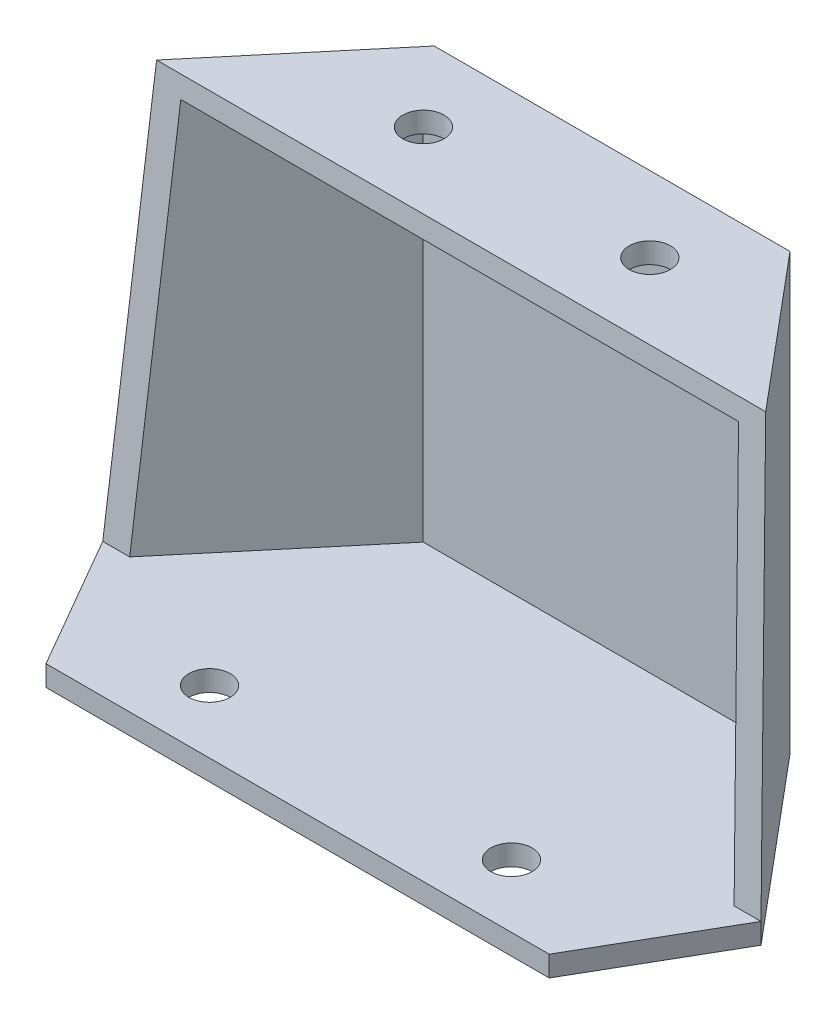
ISO-10303-21;
HEADER;
FILE_DESCRIPTION(('STEP AP214'),'2;1');
FILE_NAME('part.step','',(''),(''),'','','');
FILE_SCHEMA(('AUTOMOTIVE_DESIGN { 1 0 10303 214 1 1 1 1 }'));
ENDSEC;
DATA;
#1=APPLICATION_CONTEXT('core data for automotive mechanical design processes');
#2=APPLICATION_PROTOCOL_DEFINITION('international standard','automotive_design',2000,#1);
#3=PRODUCT_CONTEXT('',#1,'mechanical');
#4=PRODUCT('Part','Part','',(#3));
#5=PRODUCT_RELATED_PRODUCT_CATEGORY('part','',(#4));
#6=PRODUCT_DEFINITION_FORMATION('','',#4);
#7=PRODUCT_DEFINITION_CONTEXT('part definition',#1,'design');
#8=PRODUCT_DEFINITION('design','',#6,#7);
#9=PRODUCT_DEFINITION_SHAPE('','',#8);
#10=(LENGTH_UNIT() NAMED_UNIT(*) SI_UNIT(.MILLI.,.METRE.));
#11=(NAMED_UNIT(*) PLANE_ANGLE_UNIT() SI_UNIT($,.RADIAN.));
#12=(NAMED_UNIT(*) SI_UNIT($,.STERADIAN.) SOLID_ANGLE_UNIT());
#13=UNCERTAINTY_MEASURE_WITH_UNIT(LENGTH_MEASURE(1.E-05),#10,'distance_accuracy_value','');
#14=(GEOMETRIC_REPRESENTATION_CONTEXT(3) GLOBAL_UNCERTAINTY_ASSIGNED_CONTEXT((#13)) GLOBAL_UNIT_ASSIGNED_CONTEXT((#10,
#11,#12)) REPRESENTATION_CONTEXT('',''));
#15=CARTESIAN_POINT('',(0.,0.,0.));
#16=DIRECTION('',(0.,0.,1.));
#17=DIRECTION('',(1.,0.,0.));
#18=AXIS2_PLACEMENT_3D('',#15,#16,#17);
#19=CARTESIAN_POINT('',(0.,0.,0.));
#20=DIRECTION('',(0.,1.,0.));
#21=DIRECTION('',(0.,0.,1.));
#22=AXIS2_PLACEMENT_3D('',#19,#20,#21);
#23=PLANE('',#22);
#24=DIRECTION('',(-1.,0.,0.));
#25=VECTOR('',#24,1.);
#26=CARTESIAN_POINT('',(0.,0.,0.));
#27=LINE('',#26,#25);
#28=CARTESIAN_POINT('',(122.,0.,0.));
#29=VERTEX_POINT('',#28);
#30=CARTESIAN_POINT('',(-122.,0.,0.));
#31=VERTEX_POINT('',#30);
#32=EDGE_CURVE('E211',#29,#31,#27,.T.);
#33=ORIENTED_EDGE('',*,*,#32,.T.);
#34=DIRECTION('',(-0.500000000000001,0.,-0.866025403784438));
#35=VECTOR('',#34,1.);
#36=CARTESIAN_POINT('',(-91.4999999999999,0.,52.8275496308509));
#37=LINE('',#36,#35);
#38=CARTESIAN_POINT('',(-159.592352403094,0.,-65.1118643381918));
#39=VERTEX_POINT('',#38);
#40=EDGE_CURVE('E271',#31,#39,#37,.T.);
#41=ORIENTED_EDGE('',*,*,#40,.T.);
#42=DIRECTION('',(0.642787609686541,0.,-0.766044443118977));
#43=VECTOR('',#42,1.);
#44=CARTESIAN_POINT('',(-125.7139711904,0.,-105.486546859696));
#45=LINE('',#44,#43);
#46=CARTESIAN_POINT('',(-86.265,0.,-152.5));
#47=VERTEX_POINT('',#46);
#48=EDGE_CURVE('E275',#39,#47,#45,.T.);
#49=ORIENTED_EDGE('',*,*,#48,.T.);
#50=DIRECTION('',(1.,0.,0.));
#51=VECTOR('',#50,1.);
#52=CARTESIAN_POINT('',(0.,0.,-152.5));
#53=LINE('',#52,#51);
#54=CARTESIAN_POINT('',(86.265,0.,-152.5));
#55=VERTEX_POINT('',#54);
#56=EDGE_CURVE('E220',#47,#55,#53,.T.);
#57=ORIENTED_EDGE('',*,*,#56,.T.);
#58=DIRECTION('',(-0.642787609686541,0.,-0.766044443118977));
#59=VECTOR('',#58,1.);
#60=CARTESIAN_POINT('',(125.7139711904,0.,-105.486546859696));
#61=LINE('',#60,#59);
#62=CARTESIAN_POINT('',(159.592352403094,0.,-65.1118643381918));
#63=VERTEX_POINT('',#62);
#64=EDGE_CURVE('E228',#63,#55,#61,.T.);
#65=ORIENTED_EDGE('',*,*,#64,.F.);
#66=DIRECTION('',(0.500000000000001,0.,-0.866025403784438));
#67=VECTOR('',#66,1.);
#68=CARTESIAN_POINT('',(91.4999999999999,0.,52.8275496308509));
#69=LINE('',#68,#67);
#70=EDGE_CURVE('E254',#29,#63,#69,.T.);
#71=ORIENTED_EDGE('',*,*,#70,.F.);
#72=EDGE_LOOP('',(#33,#41,#49,#57,#65,#71));
#73=FACE_BOUND('',#72,.T.);
#74=CARTESIAN_POINT('',(73.2,0.,-30.5));
#75=DIRECTION('',(0.,-1.,0.));
#76=DIRECTION('',(0.,0.,-1.));
#77=AXIS2_PLACEMENT_3D('',#74,#75,#76);
#78=CIRCLE('',#77,9.99999999999999);
#79=CARTESIAN_POINT('',(73.2,0.,-40.5));
#80=VERTEX_POINT('',#79);
#81=EDGE_CURVE('E377',#80,#80,#78,.T.);
#82=ORIENTED_EDGE('',*,*,#81,.F.);
#83=EDGE_LOOP('',(#82));
#84=FACE_BOUND('',#83,.T.);
#85=CARTESIAN_POINT('',(-73.2,0.,-30.5));
#86=DIRECTION('',(0.,1.,0.));
#87=DIRECTION('',(0.,0.,1.));
#88=AXIS2_PLACEMENT_3D('',#85,#86,#87);
#89=CIRCLE('',#88,9.99999999999999);
#90=CARTESIAN_POINT('',(-73.2,0.,-20.5));
#91=VERTEX_POINT('',#90);
#92=EDGE_CURVE('E366',#91,#91,#89,.T.);
#93=ORIENTED_EDGE('',*,*,#92,.T.);
#94=EDGE_LOOP('',(#93));
#95=FACE_BOUND('',#94,.T.);
#96=ADVANCED_FACE('F89',(#73,#84,#95),#23,.F.);
#97=CARTESIAN_POINT('',(-159.592352403094,10.,0.));
#98=DIRECTION('',(0.,1.,0.));
#99=DIRECTION('',(0.,0.,1.));
#100=AXIS2_PLACEMENT_3D('',#97,#98,#99);
#101=PLANE('',#100);
#102=CARTESIAN_POINT('',(73.2,10.,-30.5));
#103=DIRECTION('',(0.,-1.,0.));
#104=DIRECTION('',(0.,0.,-1.));
#105=AXIS2_PLACEMENT_3D('',#102,#103,#104);
#106=CIRCLE('',#105,9.99999999999999);
#107=CARTESIAN_POINT('',(73.2,10.,-40.5));
#108=VERTEX_POINT('',#107);
#109=EDGE_CURVE('E381',#108,#108,#106,.T.);
#110=ORIENTED_EDGE('',*,*,#109,.T.);
#111=EDGE_LOOP('',(#110));
#112=FACE_BOUND('',#111,.T.);
#113=DIRECTION('',(1.,0.,0.));
#114=VECTOR('',#113,1.);
#115=CARTESIAN_POINT('',(-159.592352403094,10.,-65.1118643381918));
#116=LINE('',#115,#114);
#117=CARTESIAN_POINT('',(146.538279509771,10.,-65.1118643381918));
#118=VERTEX_POINT('',#117);
#119=CARTESIAN_POINT('',(159.592352403094,10.,-65.1118643381918));
#120=VERTEX_POINT('',#119);
#121=EDGE_CURVE('E182',#118,#120,#116,.T.);
#122=ORIENTED_EDGE('',*,*,#121,.F.);
#123=DIRECTION('',(-0.642787609686541,0.,-0.766044443118977));
#124=VECTOR('',#123,1.);
#125=CARTESIAN_POINT('',(118.05352675921,10.,-99.0586707628305));
#126=LINE('',#125,#124);
#127=CARTESIAN_POINT('',(81.60192341845,10.,-142.5));
#128=VERTEX_POINT('',#127);
#129=EDGE_CURVE('E109',#118,#128,#126,.T.);
#130=ORIENTED_EDGE('',*,*,#129,.T.);
#131=DIRECTION('',(1.,0.,0.));
#132=VECTOR('',#131,1.);
#133=CARTESIAN_POINT('',(0.,10.,-142.5));
#134=LINE('',#133,#132);
#135=CARTESIAN_POINT('',(-81.60192341845,10.,-142.5));
#136=VERTEX_POINT('',#135);
#137=EDGE_CURVE('E100',#136,#128,#134,.T.);
#138=ORIENTED_EDGE('',*,*,#137,.F.);
#139=DIRECTION('',(0.642787609686541,0.,-0.766044443118977));
#140=VECTOR('',#139,1.);
#141=CARTESIAN_POINT('',(-118.05352675921,10.,-99.0586707628305));
#142=LINE('',#141,#140);
#143=CARTESIAN_POINT('',(-146.538279509771,10.,-65.1118643381918));
#144=VERTEX_POINT('',#143);
#145=EDGE_CURVE('E250',#144,#136,#142,.T.);
#146=ORIENTED_EDGE('',*,*,#145,.F.);
#147=CARTESIAN_POINT('',(-159.592352403094,10.,-65.1118643381918));
#148=VERTEX_POINT('',#147);
#149=EDGE_CURVE('E187',#148,#144,#116,.T.);
#150=ORIENTED_EDGE('',*,*,#149,.F.);
#151=DIRECTION('',(-0.500000000000001,0.,-0.866025403784438));
#152=VECTOR('',#151,1.);
#153=CARTESIAN_POINT('',(-91.4999999999998,10.,52.8275496308509));
#154=LINE('',#153,#152);
#155=CARTESIAN_POINT('',(-122.,10.,0.));
#156=VERTEX_POINT('',#155);
#157=EDGE_CURVE('E221',#156,#148,#154,.T.);
#158=ORIENTED_EDGE('',*,*,#157,.F.);
#159=DIRECTION('',(1.,0.,0.));
#160=VECTOR('',#159,1.);
#161=CARTESIAN_POINT('',(-159.592352403094,10.,0.));
#162=LINE('',#161,#160);
#163=CARTESIAN_POINT('',(122.,10.,0.));
#164=VERTEX_POINT('',#163);
#165=EDGE_CURVE('E188',#156,#164,#162,.T.);
#166=ORIENTED_EDGE('',*,*,#165,.T.);
#167=DIRECTION('',(0.500000000000001,0.,-0.866025403784438));
#168=VECTOR('',#167,1.);
#169=CARTESIAN_POINT('',(91.4999999999998,10.,52.8275496308509));
#170=LINE('',#169,#168);
#171=EDGE_CURVE('E216',#164,#120,#170,.T.);
#172=ORIENTED_EDGE('',*,*,#171,.T.);
#173=EDGE_LOOP('',(#122,#130,#138,#146,#150,#158,#166,#172));
#174=FACE_BOUND('',#173,.T.);
#175=CARTESIAN_POINT('',(-73.2,10.,-30.5));
#176=DIRECTION('',(0.,1.,0.));
#177=DIRECTION('',(0.,0.,1.));
#178=AXIS2_PLACEMENT_3D('',#175,#176,#177);
#179=CIRCLE('',#178,9.99999999999999);
#180=CARTESIAN_POINT('',(-73.2,10.,-20.5));
#181=VERTEX_POINT('',#180);
#182=EDGE_CURVE('E385',#181,#181,#179,.T.);
#183=ORIENTED_EDGE('',*,*,#182,.F.);
#184=EDGE_LOOP('',(#183));
#185=FACE_BOUND('',#184,.T.);
#186=ADVANCED_FACE('F311',(#112,#174,#185),#101,.T.);
#187=CARTESIAN_POINT('',(0.,211.,0.));
#188=DIRECTION('',(0.,1.,0.));
#189=DIRECTION('',(0.,0.,1.));
#190=AXIS2_PLACEMENT_3D('',#187,#188,#189);
#191=PLANE('',#190);
#192=DIRECTION('',(0.642787609686541,0.,-0.766044443118977));
#193=VECTOR('',#192,1.);
#194=CARTESIAN_POINT('',(-125.7139711904,211.,-105.486546859696));
#195=LINE('',#194,#193);
#196=CARTESIAN_POINT('',(-147.687093002177,211.,-79.3));
#197=VERTEX_POINT('',#196);
#198=CARTESIAN_POINT('',(-86.265,211.,-152.5));
#199=VERTEX_POINT('',#198);
#200=EDGE_CURVE('E196',#197,#199,#195,.T.);
#201=ORIENTED_EDGE('',*,*,#200,.F.);
#202=DIRECTION('',(1.,0.,0.));
#203=VECTOR('',#202,1.);
#204=CARTESIAN_POINT('',(-159.592352403094,211.,-79.3));
#205=LINE('',#204,#203);
#206=CARTESIAN_POINT('',(147.687093002177,211.,-79.3));
#207=VERTEX_POINT('',#206);
#208=EDGE_CURVE('E181',#197,#207,#205,.T.);
#209=ORIENTED_EDGE('',*,*,#208,.T.);
#210=DIRECTION('',(-0.642787609686541,0.,-0.766044443118977));
#211=VECTOR('',#210,1.);
#212=CARTESIAN_POINT('',(125.7139711904,211.,-105.486546859696));
#213=LINE('',#212,#211);
#214=CARTESIAN_POINT('',(86.265,211.,-152.5));
#215=VERTEX_POINT('',#214);
#216=EDGE_CURVE('E93',#207,#215,#213,.T.);
#217=ORIENTED_EDGE('',*,*,#216,.T.);
#218=DIRECTION('',(1.,0.,0.));
#219=VECTOR('',#218,1.);
#220=CARTESIAN_POINT('',(0.,211.,-152.5));
#221=LINE('',#220,#219);
#222=EDGE_CURVE('E205',#199,#215,#221,.T.);
#223=ORIENTED_EDGE('',*,*,#222,.F.);
#224=EDGE_LOOP('',(#201,#209,#217,#223));
#225=FACE_BOUND('',#224,.T.);
#226=CARTESIAN_POINT('',(-54.9,211.,-115.9));
#227=DIRECTION('',(0.,1.,0.));
#228=DIRECTION('',(0.,0.,1.));
#229=AXIS2_PLACEMENT_3D('',#226,#227,#228);
#230=CIRCLE('',#229,10.);
#231=CARTESIAN_POINT('',(-54.9,211.,-105.9));
#232=VERTEX_POINT('',#231);
#233=EDGE_CURVE('E365',#232,#232,#230,.T.);
#234=ORIENTED_EDGE('',*,*,#233,.F.);
#235=EDGE_LOOP('',(#234));
#236=FACE_BOUND('',#235,.T.);
#237=CARTESIAN_POINT('',(54.9,211.,-115.9));
#238=DIRECTION('',(0.,-1.,0.));
#239=DIRECTION('',(0.,0.,-1.));
#240=AXIS2_PLACEMENT_3D('',#237,#238,#239);
#241=CIRCLE('',#240,10.);
#242=CARTESIAN_POINT('',(54.9,211.,-125.9));
#243=VERTEX_POINT('',#242);
#244=EDGE_CURVE('E370',#243,#243,#241,.T.);
#245=ORIENTED_EDGE('',*,*,#244,.T.);
#246=EDGE_LOOP('',(#245));
#247=FACE_BOUND('',#246,.T.);
#248=ADVANCED_FACE('F192',(#225,#236,#247),#191,.T.);
#249=CARTESIAN_POINT('',(0.,201.,0.));
#250=DIRECTION('',(0.,1.,0.));
#251=DIRECTION('',(0.,0.,1.));
#252=AXIS2_PLACEMENT_3D('',#249,#250,#251);
#253=PLANE('',#252);
#254=CARTESIAN_POINT('',(-54.9,201.,-115.9));
#255=DIRECTION('',(0.,1.,0.));
#256=DIRECTION('',(0.,0.,1.));
#257=AXIS2_PLACEMENT_3D('',#254,#255,#256);
#258=CIRCLE('',#257,10.);
#259=CARTESIAN_POINT('',(-54.9,201.,-105.9));
#260=VERTEX_POINT('',#259);
#261=EDGE_CURVE('E361',#260,#260,#258,.T.);
#262=ORIENTED_EDGE('',*,*,#261,.T.);
#263=EDGE_LOOP('',(#262));
#264=FACE_BOUND('',#263,.T.);
#265=DIRECTION('',(1.,0.,0.));
#266=VECTOR('',#265,1.);
#267=CARTESIAN_POINT('',(0.,201.,-78.5941226038901));
#268=LINE('',#267,#266);
#269=CARTESIAN_POINT('',(-135.225321571586,201.,-78.5941226038901));
#270=VERTEX_POINT('',#269);
#271=CARTESIAN_POINT('',(135.225321571586,201.,-78.5941226038901));
#272=VERTEX_POINT('',#271);
#273=EDGE_CURVE('E236',#270,#272,#268,.T.);
#274=ORIENTED_EDGE('',*,*,#273,.F.);
#275=DIRECTION('',(0.642787609686541,0.,-0.766044443118977));
#276=VECTOR('',#275,1.);
#277=CARTESIAN_POINT('',(-118.05352675921,201.,-99.0586707628305));
#278=LINE('',#277,#276);
#279=CARTESIAN_POINT('',(-81.60192341845,201.,-142.5));
#280=VERTEX_POINT('',#279);
#281=EDGE_CURVE('E246',#270,#280,#278,.T.);
#282=ORIENTED_EDGE('',*,*,#281,.T.);
#283=DIRECTION('',(1.,0.,0.));
#284=VECTOR('',#283,1.);
#285=CARTESIAN_POINT('',(0.,201.,-142.5));
#286=LINE('',#285,#284);
#287=CARTESIAN_POINT('',(81.60192341845,201.,-142.5));
#288=VERTEX_POINT('',#287);
#289=EDGE_CURVE('E249',#280,#288,#286,.T.);
#290=ORIENTED_EDGE('',*,*,#289,.T.);
#291=DIRECTION('',(-0.642787609686541,0.,-0.766044443118977));
#292=VECTOR('',#291,1.);
#293=CARTESIAN_POINT('',(118.05352675921,201.,-99.0586707628305));
#294=LINE('',#293,#292);
#295=EDGE_CURVE('E233',#272,#288,#294,.T.);
#296=ORIENTED_EDGE('',*,*,#295,.F.);
#297=EDGE_LOOP('',(#274,#282,#290,#296));
#298=FACE_BOUND('',#297,.T.);
#299=CARTESIAN_POINT('',(54.9,201.,-115.9));
#300=DIRECTION('',(0.,-1.,0.));
#301=DIRECTION('',(0.,0.,-1.));
#302=AXIS2_PLACEMENT_3D('',#299,#300,#301);
#303=CIRCLE('',#302,10.);
#304=CARTESIAN_POINT('',(54.9,201.,-125.9));
#305=VERTEX_POINT('',#304);
#306=EDGE_CURVE('E262',#305,#305,#303,.T.);
#307=ORIENTED_EDGE('',*,*,#306,.F.);
#308=EDGE_LOOP('',(#307));
#309=FACE_BOUND('',#308,.T.);
#310=ADVANCED_FACE('F318',(#264,#298,#309),#253,.F.);
#311=CARTESIAN_POINT('',(0.,211.,0.));
#312=DIRECTION('',(0.,0.,1.));
#313=DIRECTION('',(1.,0.,0.));
#314=AXIS2_PLACEMENT_3D('',#311,#312,#313);
#315=PLANE('',#314);
#316=DIRECTION('',(0.,-1.,0.));
#317=VECTOR('',#316,1.);
#318=CARTESIAN_POINT('',(122.,211.,0.));
#319=LINE('',#318,#317);
#320=EDGE_CURVE('E251',#164,#29,#319,.T.);
#321=ORIENTED_EDGE('',*,*,#320,.F.);
#322=ORIENTED_EDGE('',*,*,#165,.F.);
#323=DIRECTION('',(0.,-1.,0.));
#324=VECTOR('',#323,1.);
#325=CARTESIAN_POINT('',(-122.,211.,0.));
#326=LINE('',#325,#324);
#327=EDGE_CURVE('E255',#156,#31,#326,.T.);
#328=ORIENTED_EDGE('',*,*,#327,.T.);
#329=ORIENTED_EDGE('',*,*,#32,.F.);
#330=EDGE_LOOP('',(#321,#322,#328,#329));
#331=FACE_BOUND('',#330,.T.);
#332=ADVANCED_FACE('F91',(#331),#315,.T.);
#333=CARTESIAN_POINT('',(91.4999999999999,211.,52.8275496308509));
#334=DIRECTION('',(-0.866025403784438,0.,-0.500000000000001));
#335=DIRECTION('',(-0.500000000000001,0.,0.866025403784438));
#336=AXIS2_PLACEMENT_3D('',#333,#334,#335);
#337=PLANE('',#336);
#338=ORIENTED_EDGE('',*,*,#171,.F.);
#339=ORIENTED_EDGE('',*,*,#320,.T.);
#340=ORIENTED_EDGE('',*,*,#70,.T.);
#341=DIRECTION('',(0.,-1.,0.));
#342=VECTOR('',#341,1.);
#343=CARTESIAN_POINT('',(159.592352403094,211.,-65.1118643381918));
#344=LINE('',#343,#342);
#345=EDGE_CURVE('E256',#120,#63,#344,.T.);
#346=ORIENTED_EDGE('',*,*,#345,.F.);
#347=EDGE_LOOP('',(#338,#339,#340,#346));
#348=FACE_BOUND('',#347,.T.);
#349=ADVANCED_FACE('F289',(#348),#337,.F.);
#350=CARTESIAN_POINT('',(125.7139711904,211.,-105.486546859696));
#351=DIRECTION('',(-0.766044443118977,0.,0.642787609686541));
#352=DIRECTION('',(0.642787609686541,0.,0.766044443118977));
#353=AXIS2_PLACEMENT_3D('',#350,#351,#352);
#354=PLANE('',#353);
#355=DIRECTION('',(-0.0589802795117459,0.995781425892182,-0.0702899600003336));
#356=VECTOR('',#355,1.);
#357=CARTESIAN_POINT('',(147.502093558442,214.123400082145,-79.5204737516994));
#358=LINE('',#357,#356);
#359=EDGE_CURVE('E178',#120,#207,#358,.T.);
#360=ORIENTED_EDGE('',*,*,#359,.F.);
#361=ORIENTED_EDGE('',*,*,#345,.T.);
#362=ORIENTED_EDGE('',*,*,#64,.T.);
#363=DIRECTION('',(0.,-1.,0.));
#364=VECTOR('',#363,1.);
#365=CARTESIAN_POINT('',(86.265,211.,-152.5));
#366=LINE('',#365,#364);
#367=EDGE_CURVE('E202',#215,#55,#366,.T.);
#368=ORIENTED_EDGE('',*,*,#367,.F.);
#369=ORIENTED_EDGE('',*,*,#216,.F.);
#370=EDGE_LOOP('',(#360,#361,#362,#368,#369));
#371=FACE_BOUND('',#370,.T.);
#372=ADVANCED_FACE('F200',(#371),#354,.F.);
#373=CARTESIAN_POINT('',(-125.7139711904,211.,-105.486546859696));
#374=DIRECTION('',(-0.766044443118977,0.,-0.642787609686541));
#375=DIRECTION('',(-0.642787609686541,0.,0.766044443118977));
#376=AXIS2_PLACEMENT_3D('',#373,#374,#375);
#377=PLANE('',#376);
#378=DIRECTION('',(0.,-1.,0.));
#379=VECTOR('',#378,1.);
#380=CARTESIAN_POINT('',(-159.592352403094,211.,-65.1118643381918));
#381=LINE('',#380,#379);
#382=EDGE_CURVE('E198',#148,#39,#381,.T.);
#383=ORIENTED_EDGE('',*,*,#382,.F.);
#384=DIRECTION('',(0.0589802795117459,0.995781425892182,-0.0702899600003336));
#385=VECTOR('',#384,1.);
#386=CARTESIAN_POINT('',(-147.502093558442,214.123400082145,-79.5204737516994));
#387=LINE('',#386,#385);
#388=EDGE_CURVE('E168',#148,#197,#387,.T.);
#389=ORIENTED_EDGE('',*,*,#388,.T.);
#390=ORIENTED_EDGE('',*,*,#200,.T.);
#391=DIRECTION('',(0.,-1.,0.));
#392=VECTOR('',#391,1.);
#393=CARTESIAN_POINT('',(-86.265,211.,-152.5));
#394=LINE('',#393,#392);
#395=EDGE_CURVE('E224',#199,#47,#394,.T.);
#396=ORIENTED_EDGE('',*,*,#395,.T.);
#397=ORIENTED_EDGE('',*,*,#48,.F.);
#398=EDGE_LOOP('',(#383,#389,#390,#396,#397));
#399=FACE_BOUND('',#398,.T.);
#400=ADVANCED_FACE('F305',(#399),#377,.T.);
#401=CARTESIAN_POINT('',(-91.4999999999999,211.,52.8275496308509));
#402=DIRECTION('',(-0.866025403784438,0.,0.500000000000001));
#403=DIRECTION('',(0.500000000000001,0.,0.866025403784438));
#404=AXIS2_PLACEMENT_3D('',#401,#402,#403);
#405=PLANE('',#404);
#406=ORIENTED_EDGE('',*,*,#327,.F.);
#407=ORIENTED_EDGE('',*,*,#157,.T.);
#408=ORIENTED_EDGE('',*,*,#382,.T.);
#409=ORIENTED_EDGE('',*,*,#40,.F.);
#410=EDGE_LOOP('',(#406,#407,#408,#409));
#411=FACE_BOUND('',#410,.T.);
#412=ADVANCED_FACE('F297',(#411),#405,.T.);
#413=CARTESIAN_POINT('',(0.,211.,-152.5));
#414=DIRECTION('',(0.,0.,-1.));
#415=DIRECTION('',(-1.,0.,0.));
#416=AXIS2_PLACEMENT_3D('',#413,#414,#415);
#417=PLANE('',#416);
#418=ORIENTED_EDGE('',*,*,#56,.F.);
#419=ORIENTED_EDGE('',*,*,#395,.F.);
#420=ORIENTED_EDGE('',*,*,#222,.T.);
#421=ORIENTED_EDGE('',*,*,#367,.T.);
#422=EDGE_LOOP('',(#418,#419,#420,#421));
#423=FACE_BOUND('',#422,.T.);
#424=ADVANCED_FACE('F295',(#423),#417,.T.);
#425=CARTESIAN_POINT('',(-159.592352403094,211.,-79.3));
#426=DIRECTION('',(0.,0.0704125378053742,0.997517956991155));
#427=DIRECTION('',(0.,-0.997517956991155,0.0704125378053742));
#428=AXIS2_PLACEMENT_3D('',#425,#426,#427);
#429=PLANE('',#428);
#430=ORIENTED_EDGE('',*,*,#359,.T.);
#431=ORIENTED_EDGE('',*,*,#208,.F.);
#432=ORIENTED_EDGE('',*,*,#388,.F.);
#433=ORIENTED_EDGE('',*,*,#149,.T.);
#434=DIRECTION('',(0.0589802795117459,0.995781425892182,-0.0702899600003336));
#435=VECTOR('',#434,1.);
#436=CARTESIAN_POINT('',(-134.49343152088,213.356715232992,-79.4663552012037));
#437=LINE('',#436,#435);
#438=EDGE_CURVE('E172',#144,#270,#437,.T.);
#439=ORIENTED_EDGE('',*,*,#438,.T.);
#440=ORIENTED_EDGE('',*,*,#273,.T.);
#441=DIRECTION('',(-0.0589802795117459,0.995781425892182,-0.0702899600003336));
#442=VECTOR('',#441,1.);
#443=CARTESIAN_POINT('',(134.49343152088,213.356715232992,-79.4663552012037));
#444=LINE('',#443,#442);
#445=EDGE_CURVE('E229',#118,#272,#444,.T.);
#446=ORIENTED_EDGE('',*,*,#445,.F.);
#447=ORIENTED_EDGE('',*,*,#121,.T.);
#448=EDGE_LOOP('',(#430,#431,#432,#433,#439,#440,#446,#447));
#449=FACE_BOUND('',#448,.T.);
#450=ADVANCED_FACE('F180',(#449),#429,.T.);
#451=CARTESIAN_POINT('',(118.05352675921,211.,-99.0586707628305));
#452=DIRECTION('',(-0.766044443118977,0.,0.642787609686541));
#453=DIRECTION('',(0.642787609686541,0.,0.766044443118977));
#454=AXIS2_PLACEMENT_3D('',#451,#452,#453);
#455=PLANE('',#454);
#456=ORIENTED_EDGE('',*,*,#129,.F.);
#457=ORIENTED_EDGE('',*,*,#445,.T.);
#458=ORIENTED_EDGE('',*,*,#295,.T.);
#459=DIRECTION('',(0.,-1.,0.));
#460=VECTOR('',#459,1.);
#461=CARTESIAN_POINT('',(81.60192341845,211.,-142.5));
#462=LINE('',#461,#460);
#463=EDGE_CURVE('E245',#288,#128,#462,.T.);
#464=ORIENTED_EDGE('',*,*,#463,.T.);
#465=EDGE_LOOP('',(#456,#457,#458,#464));
#466=FACE_BOUND('',#465,.T.);
#467=ADVANCED_FACE('F303',(#466),#455,.T.);
#468=CARTESIAN_POINT('',(-118.05352675921,211.,-99.0586707628305));
#469=DIRECTION('',(-0.766044443118977,0.,-0.642787609686541));
#470=DIRECTION('',(-0.642787609686541,0.,0.766044443118977));
#471=AXIS2_PLACEMENT_3D('',#468,#469,#470);
#472=PLANE('',#471);
#473=ORIENTED_EDGE('',*,*,#438,.F.);
#474=ORIENTED_EDGE('',*,*,#145,.T.);
#475=DIRECTION('',(0.,-1.,0.));
#476=VECTOR('',#475,1.);
#477=CARTESIAN_POINT('',(-81.60192341845,211.,-142.5));
#478=LINE('',#477,#476);
#479=EDGE_CURVE('E12',#280,#136,#478,.T.);
#480=ORIENTED_EDGE('',*,*,#479,.F.);
#481=ORIENTED_EDGE('',*,*,#281,.F.);
#482=EDGE_LOOP('',(#473,#474,#480,#481));
#483=FACE_BOUND('',#482,.T.);
#484=ADVANCED_FACE('F322',(#483),#472,.F.);
#485=CARTESIAN_POINT('',(0.,211.,-142.5));
#486=DIRECTION('',(0.,0.,-1.));
#487=DIRECTION('',(-1.,0.,0.));
#488=AXIS2_PLACEMENT_3D('',#485,#486,#487);
#489=PLANE('',#488);
#490=ORIENTED_EDGE('',*,*,#137,.T.);
#491=ORIENTED_EDGE('',*,*,#463,.F.);
#492=ORIENTED_EDGE('',*,*,#289,.F.);
#493=ORIENTED_EDGE('',*,*,#479,.T.);
#494=EDGE_LOOP('',(#490,#491,#492,#493));
#495=FACE_BOUND('',#494,.T.);
#496=ADVANCED_FACE('F325',(#495),#489,.F.);
#497=CARTESIAN_POINT('',(-54.9,201.,-115.9));
#498=DIRECTION('',(0.,1.,0.));
#499=DIRECTION('',(0.,0.,1.));
#500=AXIS2_PLACEMENT_3D('',#497,#498,#499);
#501=CYLINDRICAL_SURFACE('',#500,10.);
#502=ORIENTED_EDGE('',*,*,#261,.F.);
#503=EDGE_LOOP('',(#502));
#504=FACE_BOUND('',#503,.T.);
#505=ORIENTED_EDGE('',*,*,#233,.T.);
#506=EDGE_LOOP('',(#505));
#507=FACE_BOUND('',#506,.T.);
#508=ADVANCED_FACE('F410',(#504,#507),#501,.F.);
#509=CARTESIAN_POINT('',(54.9,201.,-115.9));
#510=DIRECTION('',(0.,1.,0.));
#511=DIRECTION('',(0.,0.,1.));
#512=AXIS2_PLACEMENT_3D('',#509,#510,#511);
#513=CYLINDRICAL_SURFACE('',#512,10.);
#514=ORIENTED_EDGE('',*,*,#306,.T.);
#515=EDGE_LOOP('',(#514));
#516=FACE_BOUND('',#515,.T.);
#517=ORIENTED_EDGE('',*,*,#244,.F.);
#518=EDGE_LOOP('',(#517));
#519=FACE_BOUND('',#518,.T.);
#520=ADVANCED_FACE('F404',(#516,#519),#513,.F.);
#521=CARTESIAN_POINT('',(73.2,0.,-30.5));
#522=DIRECTION('',(0.,1.,0.));
#523=DIRECTION('',(0.,0.,1.));
#524=AXIS2_PLACEMENT_3D('',#521,#522,#523);
#525=CYLINDRICAL_SURFACE('',#524,9.99999999999999);
#526=ORIENTED_EDGE('',*,*,#81,.T.);
#527=EDGE_LOOP('',(#526));
#528=FACE_BOUND('',#527,.T.);
#529=ORIENTED_EDGE('',*,*,#109,.F.);
#530=EDGE_LOOP('',(#529));
#531=FACE_BOUND('',#530,.T.);
#532=ADVANCED_FACE('F397',(#528,#531),#525,.F.);
#533=CARTESIAN_POINT('',(-73.2,0.,-30.5));
#534=DIRECTION('',(0.,1.,0.));
#535=DIRECTION('',(0.,0.,1.));
#536=AXIS2_PLACEMENT_3D('',#533,#534,#535);
#537=CYLINDRICAL_SURFACE('',#536,9.99999999999999);
#538=ORIENTED_EDGE('',*,*,#92,.F.);
#539=EDGE_LOOP('',(#538));
#540=FACE_BOUND('',#539,.T.);
#541=ORIENTED_EDGE('',*,*,#182,.T.);
#542=EDGE_LOOP('',(#541));
#543=FACE_BOUND('',#542,.T.);
#544=ADVANCED_FACE('F394',(#540,#543),#537,.F.);
#545=CLOSED_SHELL('',(#96,#186,#248,#310,#332,#349,#372,#400,#412,#424,#450,#467,#484,#496,#508,
#520,#532,#544));
#546=MANIFOLD_SOLID_BREP('B2',#545);
#547=ADVANCED_BREP_SHAPE_REPRESENTATION('',(#18,#546),#14);
#548=SHAPE_DEFINITION_REPRESENTATION(#9,#547);
ENDSEC;
END-ISO-10303-21;
